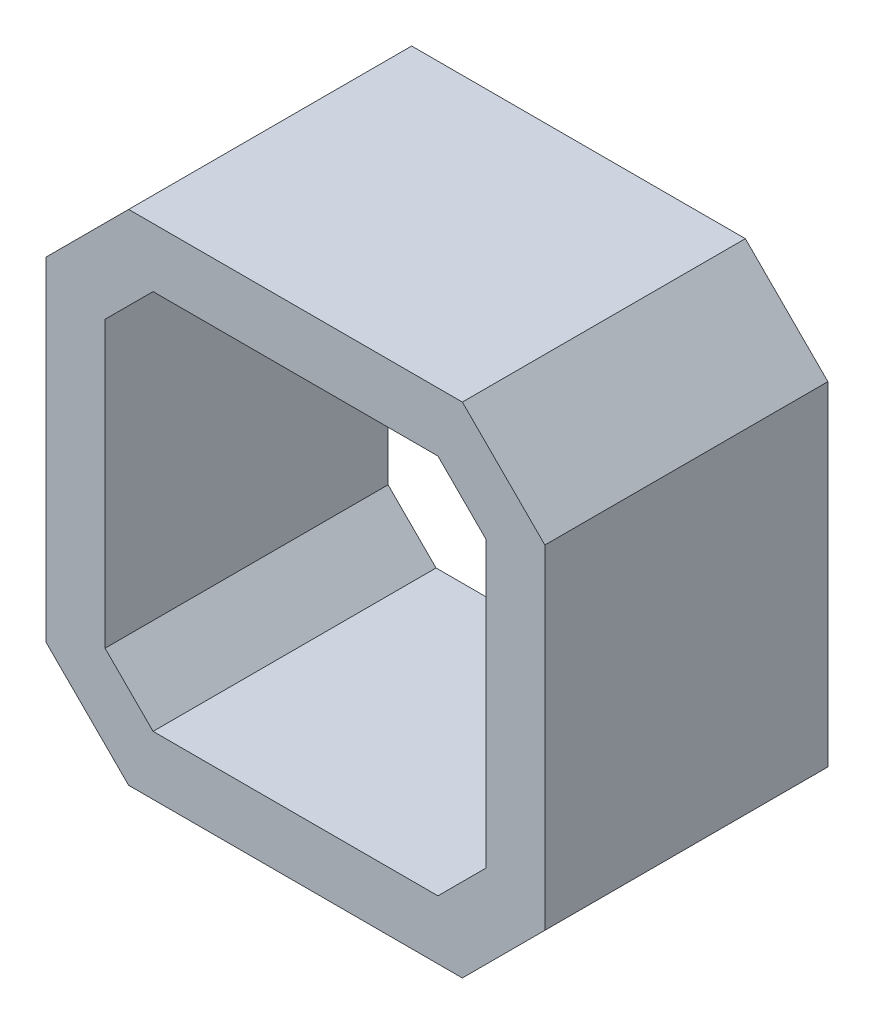
ISO-10303-21;
HEADER;
FILE_DESCRIPTION(('STEP AP214'),'2;1');
FILE_NAME('part.step','',(''),(''),'','','');
FILE_SCHEMA(('AUTOMOTIVE_DESIGN { 1 0 10303 214 1 1 1 1 }'));
ENDSEC;
DATA;
#1=APPLICATION_CONTEXT('core data for automotive mechanical design processes');
#2=APPLICATION_PROTOCOL_DEFINITION('international standard','automotive_design',2000,#1);
#3=PRODUCT_CONTEXT('',#1,'mechanical');
#4=PRODUCT('Part','Part','',(#3));
#5=PRODUCT_RELATED_PRODUCT_CATEGORY('part','',(#4));
#6=PRODUCT_DEFINITION_FORMATION('','',#4);
#7=PRODUCT_DEFINITION_CONTEXT('part definition',#1,'design');
#8=PRODUCT_DEFINITION('design','',#6,#7);
#9=PRODUCT_DEFINITION_SHAPE('','',#8);
#10=(LENGTH_UNIT() NAMED_UNIT(*) SI_UNIT(.MILLI.,.METRE.));
#11=(NAMED_UNIT(*) PLANE_ANGLE_UNIT() SI_UNIT($,.RADIAN.));
#12=(NAMED_UNIT(*) SI_UNIT($,.STERADIAN.) SOLID_ANGLE_UNIT());
#13=UNCERTAINTY_MEASURE_WITH_UNIT(LENGTH_MEASURE(1.E-05),#10,'distance_accuracy_value','');
#14=(GEOMETRIC_REPRESENTATION_CONTEXT(3) GLOBAL_UNCERTAINTY_ASSIGNED_CONTEXT((#13)) GLOBAL_UNIT_ASSIGNED_CONTEXT((#10,
#11,#12)) REPRESENTATION_CONTEXT('',''));
#15=CARTESIAN_POINT('',(0.,0.,0.));
#16=DIRECTION('',(0.,0.,1.));
#17=DIRECTION('',(1.,0.,0.));
#18=AXIS2_PLACEMENT_3D('',#15,#16,#17);
#19=CARTESIAN_POINT('',(0.,0.,-24.));
#20=DIRECTION('',(0.,0.,1.));
#21=DIRECTION('',(-1.,0.,0.));
#22=AXIS2_PLACEMENT_3D('',#19,#20,#21);
#23=PLANE('',#22);
#24=DIRECTION('',(0.,-1.,0.));
#25=VECTOR('',#24,1.);
#26=CARTESIAN_POINT('',(-21.15,-14.15,-24.));
#27=LINE('',#26,#25);
#28=CARTESIAN_POINT('',(-21.15,14.15,-24.));
#29=VERTEX_POINT('',#28);
#30=CARTESIAN_POINT('',(-21.15,-14.15,-24.));
#31=VERTEX_POINT('',#30);
#32=EDGE_CURVE('E215',#29,#31,#27,.T.);
#33=ORIENTED_EDGE('',*,*,#32,.F.);
#34=DIRECTION('',(-0.707106781186547,-0.707106781186547,0.));
#35=VECTOR('',#34,1.);
#36=CARTESIAN_POINT('',(-21.15,14.15,-24.));
#37=LINE('',#36,#35);
#38=CARTESIAN_POINT('',(-14.15,21.15,-24.));
#39=VERTEX_POINT('',#38);
#40=EDGE_CURVE('E237',#39,#29,#37,.T.);
#41=ORIENTED_EDGE('',*,*,#40,.F.);
#42=DIRECTION('',(-1.,0.,0.));
#43=VECTOR('',#42,1.);
#44=CARTESIAN_POINT('',(-14.15,21.15,-24.));
#45=LINE('',#44,#43);
#46=CARTESIAN_POINT('',(14.15,21.15,-24.));
#47=VERTEX_POINT('',#46);
#48=EDGE_CURVE('E234',#47,#39,#45,.T.);
#49=ORIENTED_EDGE('',*,*,#48,.F.);
#50=DIRECTION('',(-0.707106781186547,0.707106781186547,0.));
#51=VECTOR('',#50,1.);
#52=CARTESIAN_POINT('',(14.15,21.15,-24.));
#53=LINE('',#52,#51);
#54=CARTESIAN_POINT('',(21.15,14.15,-24.));
#55=VERTEX_POINT('',#54);
#56=EDGE_CURVE('E231',#55,#47,#53,.T.);
#57=ORIENTED_EDGE('',*,*,#56,.F.);
#58=DIRECTION('',(0.,1.,0.));
#59=VECTOR('',#58,1.);
#60=CARTESIAN_POINT('',(21.15,-14.15,-24.));
#61=LINE('',#60,#59);
#62=CARTESIAN_POINT('',(21.15,-14.15,-24.));
#63=VERTEX_POINT('',#62);
#64=EDGE_CURVE('E228',#63,#55,#61,.T.);
#65=ORIENTED_EDGE('',*,*,#64,.F.);
#66=DIRECTION('',(0.707106781186547,0.707106781186547,0.));
#67=VECTOR('',#66,1.);
#68=CARTESIAN_POINT('',(14.15,-21.15,-24.));
#69=LINE('',#68,#67);
#70=CARTESIAN_POINT('',(14.15,-21.15,-24.));
#71=VERTEX_POINT('',#70);
#72=EDGE_CURVE('E225',#71,#63,#69,.T.);
#73=ORIENTED_EDGE('',*,*,#72,.F.);
#74=DIRECTION('',(1.,0.,0.));
#75=VECTOR('',#74,1.);
#76=CARTESIAN_POINT('',(-14.15,-21.15,-24.));
#77=LINE('',#76,#75);
#78=CARTESIAN_POINT('',(-14.15,-21.15,-24.));
#79=VERTEX_POINT('',#78);
#80=EDGE_CURVE('E222',#79,#71,#77,.T.);
#81=ORIENTED_EDGE('',*,*,#80,.F.);
#82=DIRECTION('',(0.707106781186547,-0.707106781186547,0.));
#83=VECTOR('',#82,1.);
#84=CARTESIAN_POINT('',(-21.15,-14.15,-24.));
#85=LINE('',#84,#83);
#86=EDGE_CURVE('E218',#31,#79,#85,.T.);
#87=ORIENTED_EDGE('',*,*,#86,.F.);
#88=EDGE_LOOP('',(#33,#41,#49,#57,#65,#73,#81,#87));
#89=FACE_BOUND('',#88,.T.);
#90=DIRECTION('',(-0.707106781186547,-0.707106781186547,0.));
#91=VECTOR('',#90,1.);
#92=CARTESIAN_POINT('',(-16.15,12.0789321881345,-24.));
#93=LINE('',#92,#91);
#94=CARTESIAN_POINT('',(-12.0789321881345,16.15,-24.));
#95=VERTEX_POINT('',#94);
#96=CARTESIAN_POINT('',(-16.15,12.0789321881345,-24.));
#97=VERTEX_POINT('',#96);
#98=EDGE_CURVE('E150',#95,#97,#93,.T.);
#99=ORIENTED_EDGE('',*,*,#98,.T.);
#100=DIRECTION('',(0.,-1.,0.));
#101=VECTOR('',#100,1.);
#102=CARTESIAN_POINT('',(-16.15,-12.0789321881345,-24.));
#103=LINE('',#102,#101);
#104=CARTESIAN_POINT('',(-16.15,-12.0789321881345,-24.));
#105=VERTEX_POINT('',#104);
#106=EDGE_CURVE('E159',#97,#105,#103,.T.);
#107=ORIENTED_EDGE('',*,*,#106,.T.);
#108=DIRECTION('',(0.707106781186547,-0.707106781186547,0.));
#109=VECTOR('',#108,1.);
#110=CARTESIAN_POINT('',(-16.15,-12.0789321881345,-24.));
#111=LINE('',#110,#109);
#112=CARTESIAN_POINT('',(-12.0789321881345,-16.15,-24.));
#113=VERTEX_POINT('',#112);
#114=EDGE_CURVE('E164',#105,#113,#111,.T.);
#115=ORIENTED_EDGE('',*,*,#114,.T.);
#116=DIRECTION('',(1.,0.,0.));
#117=VECTOR('',#116,1.);
#118=CARTESIAN_POINT('',(-12.0789321881345,-16.15,-24.));
#119=LINE('',#118,#117);
#120=CARTESIAN_POINT('',(12.0789321881345,-16.15,-24.));
#121=VERTEX_POINT('',#120);
#122=EDGE_CURVE('E176',#113,#121,#119,.T.);
#123=ORIENTED_EDGE('',*,*,#122,.T.);
#124=DIRECTION('',(0.707106781186547,0.707106781186547,0.));
#125=VECTOR('',#124,1.);
#126=CARTESIAN_POINT('',(12.0789321881345,-16.15,-24.));
#127=LINE('',#126,#125);
#128=CARTESIAN_POINT('',(16.15,-12.0789321881345,-24.));
#129=VERTEX_POINT('',#128);
#130=EDGE_CURVE('E179',#121,#129,#127,.T.);
#131=ORIENTED_EDGE('',*,*,#130,.T.);
#132=DIRECTION('',(0.,1.,0.));
#133=VECTOR('',#132,1.);
#134=CARTESIAN_POINT('',(16.15,-12.0789321881345,-24.));
#135=LINE('',#134,#133);
#136=CARTESIAN_POINT('',(16.15,12.0789321881345,-24.));
#137=VERTEX_POINT('',#136);
#138=EDGE_CURVE('E182',#129,#137,#135,.T.);
#139=ORIENTED_EDGE('',*,*,#138,.T.);
#140=DIRECTION('',(-0.707106781186547,0.707106781186547,0.));
#141=VECTOR('',#140,1.);
#142=CARTESIAN_POINT('',(12.0789321881345,16.15,-24.));
#143=LINE('',#142,#141);
#144=CARTESIAN_POINT('',(12.0789321881345,16.15,-24.));
#145=VERTEX_POINT('',#144);
#146=EDGE_CURVE('E185',#137,#145,#143,.T.);
#147=ORIENTED_EDGE('',*,*,#146,.T.);
#148=DIRECTION('',(-1.,0.,0.));
#149=VECTOR('',#148,1.);
#150=CARTESIAN_POINT('',(-12.0789321881345,16.15,-24.));
#151=LINE('',#150,#149);
#152=EDGE_CURVE('E168',#145,#95,#151,.T.);
#153=ORIENTED_EDGE('',*,*,#152,.T.);
#154=EDGE_LOOP('',(#99,#107,#115,#123,#131,#139,#147,#153));
#155=FACE_BOUND('',#154,.T.);
#156=ADVANCED_FACE('F35',(#89,#155),#23,.F.);
#157=CARTESIAN_POINT('',(0.,0.,0.));
#158=DIRECTION('',(0.,0.,1.));
#159=DIRECTION('',(-1.,0.,0.));
#160=AXIS2_PLACEMENT_3D('',#157,#158,#159);
#161=PLANE('',#160);
#162=DIRECTION('',(0.,-1.,0.));
#163=VECTOR('',#162,1.);
#164=CARTESIAN_POINT('',(-21.15,-14.15,0.));
#165=LINE('',#164,#163);
#166=CARTESIAN_POINT('',(-21.15,14.15,0.));
#167=VERTEX_POINT('',#166);
#168=CARTESIAN_POINT('',(-21.15,-14.15,0.));
#169=VERTEX_POINT('',#168);
#170=EDGE_CURVE('E155',#167,#169,#165,.T.);
#171=ORIENTED_EDGE('',*,*,#170,.T.);
#172=DIRECTION('',(0.707106781186547,-0.707106781186547,0.));
#173=VECTOR('',#172,1.);
#174=CARTESIAN_POINT('',(-21.15,-14.15,0.));
#175=LINE('',#174,#173);
#176=CARTESIAN_POINT('',(-14.15,-21.15,0.));
#177=VERTEX_POINT('',#176);
#178=EDGE_CURVE('E243',#169,#177,#175,.T.);
#179=ORIENTED_EDGE('',*,*,#178,.T.);
#180=DIRECTION('',(1.,0.,0.));
#181=VECTOR('',#180,1.);
#182=CARTESIAN_POINT('',(-14.15,-21.15,0.));
#183=LINE('',#182,#181);
#184=CARTESIAN_POINT('',(14.15,-21.15,0.));
#185=VERTEX_POINT('',#184);
#186=EDGE_CURVE('E246',#177,#185,#183,.T.);
#187=ORIENTED_EDGE('',*,*,#186,.T.);
#188=DIRECTION('',(0.707106781186547,0.707106781186547,0.));
#189=VECTOR('',#188,1.);
#190=CARTESIAN_POINT('',(14.15,-21.15,0.));
#191=LINE('',#190,#189);
#192=CARTESIAN_POINT('',(21.15,-14.15,0.));
#193=VERTEX_POINT('',#192);
#194=EDGE_CURVE('E249',#185,#193,#191,.T.);
#195=ORIENTED_EDGE('',*,*,#194,.T.);
#196=DIRECTION('',(0.,1.,0.));
#197=VECTOR('',#196,1.);
#198=CARTESIAN_POINT('',(21.15,-14.15,0.));
#199=LINE('',#198,#197);
#200=CARTESIAN_POINT('',(21.15,14.15,0.));
#201=VERTEX_POINT('',#200);
#202=EDGE_CURVE('E252',#193,#201,#199,.T.);
#203=ORIENTED_EDGE('',*,*,#202,.T.);
#204=DIRECTION('',(-0.707106781186547,0.707106781186547,0.));
#205=VECTOR('',#204,1.);
#206=CARTESIAN_POINT('',(14.15,21.15,0.));
#207=LINE('',#206,#205);
#208=CARTESIAN_POINT('',(14.15,21.15,0.));
#209=VERTEX_POINT('',#208);
#210=EDGE_CURVE('E255',#201,#209,#207,.T.);
#211=ORIENTED_EDGE('',*,*,#210,.T.);
#212=DIRECTION('',(-1.,0.,0.));
#213=VECTOR('',#212,1.);
#214=CARTESIAN_POINT('',(-14.15,21.15,0.));
#215=LINE('',#214,#213);
#216=CARTESIAN_POINT('',(-14.15,21.15,0.));
#217=VERTEX_POINT('',#216);
#218=EDGE_CURVE('E258',#209,#217,#215,.T.);
#219=ORIENTED_EDGE('',*,*,#218,.T.);
#220=DIRECTION('',(-0.707106781186547,-0.707106781186547,0.));
#221=VECTOR('',#220,1.);
#222=CARTESIAN_POINT('',(-21.15,14.15,0.));
#223=LINE('',#222,#221);
#224=EDGE_CURVE('E219',#217,#167,#223,.T.);
#225=ORIENTED_EDGE('',*,*,#224,.T.);
#226=EDGE_LOOP('',(#171,#179,#187,#195,#203,#211,#219,#225));
#227=FACE_BOUND('',#226,.T.);
#228=DIRECTION('',(-1.,0.,0.));
#229=VECTOR('',#228,1.);
#230=CARTESIAN_POINT('',(-12.0789321881345,16.15,0.));
#231=LINE('',#230,#229);
#232=CARTESIAN_POINT('',(12.0789321881345,16.15,0.));
#233=VERTEX_POINT('',#232);
#234=CARTESIAN_POINT('',(-12.0789321881345,16.15,0.));
#235=VERTEX_POINT('',#234);
#236=EDGE_CURVE('E169',#233,#235,#231,.T.);
#237=ORIENTED_EDGE('',*,*,#236,.F.);
#238=DIRECTION('',(-0.707106781186547,0.707106781186547,0.));
#239=VECTOR('',#238,1.);
#240=CARTESIAN_POINT('',(12.0789321881345,16.15,0.));
#241=LINE('',#240,#239);
#242=CARTESIAN_POINT('',(16.15,12.0789321881345,0.));
#243=VERTEX_POINT('',#242);
#244=EDGE_CURVE('E172',#243,#233,#241,.T.);
#245=ORIENTED_EDGE('',*,*,#244,.F.);
#246=DIRECTION('',(0.,1.,0.));
#247=VECTOR('',#246,1.);
#248=CARTESIAN_POINT('',(16.15,-12.0789321881345,0.));
#249=LINE('',#248,#247);
#250=CARTESIAN_POINT('',(16.15,-12.0789321881345,0.));
#251=VERTEX_POINT('',#250);
#252=EDGE_CURVE('E200',#251,#243,#249,.T.);
#253=ORIENTED_EDGE('',*,*,#252,.F.);
#254=DIRECTION('',(0.707106781186547,0.707106781186547,0.));
#255=VECTOR('',#254,1.);
#256=CARTESIAN_POINT('',(12.0789321881345,-16.15,0.));
#257=LINE('',#256,#255);
#258=CARTESIAN_POINT('',(12.0789321881345,-16.15,0.));
#259=VERTEX_POINT('',#258);
#260=EDGE_CURVE('E197',#259,#251,#257,.T.);
#261=ORIENTED_EDGE('',*,*,#260,.F.);
#262=DIRECTION('',(1.,0.,0.));
#263=VECTOR('',#262,1.);
#264=CARTESIAN_POINT('',(-12.0789321881345,-16.15,0.));
#265=LINE('',#264,#263);
#266=CARTESIAN_POINT('',(-12.0789321881345,-16.15,0.));
#267=VERTEX_POINT('',#266);
#268=EDGE_CURVE('E194',#267,#259,#265,.T.);
#269=ORIENTED_EDGE('',*,*,#268,.F.);
#270=DIRECTION('',(0.707106781186547,-0.707106781186547,0.));
#271=VECTOR('',#270,1.);
#272=CARTESIAN_POINT('',(-16.15,-12.0789321881345,0.));
#273=LINE('',#272,#271);
#274=CARTESIAN_POINT('',(-16.15,-12.0789321881345,0.));
#275=VERTEX_POINT('',#274);
#276=EDGE_CURVE('E191',#275,#267,#273,.T.);
#277=ORIENTED_EDGE('',*,*,#276,.F.);
#278=DIRECTION('',(0.,-1.,0.));
#279=VECTOR('',#278,1.);
#280=CARTESIAN_POINT('',(-16.15,-12.0789321881345,0.));
#281=LINE('',#280,#279);
#282=CARTESIAN_POINT('',(-16.15,12.0789321881345,0.));
#283=VERTEX_POINT('',#282);
#284=EDGE_CURVE('E189',#283,#275,#281,.T.);
#285=ORIENTED_EDGE('',*,*,#284,.F.);
#286=DIRECTION('',(-0.707106781186547,-0.707106781186547,0.));
#287=VECTOR('',#286,1.);
#288=CARTESIAN_POINT('',(-16.15,12.0789321881345,0.));
#289=LINE('',#288,#287);
#290=EDGE_CURVE('E151',#235,#283,#289,.T.);
#291=ORIENTED_EDGE('',*,*,#290,.F.);
#292=EDGE_LOOP('',(#237,#245,#253,#261,#269,#277,#285,#291));
#293=FACE_BOUND('',#292,.T.);
#294=ADVANCED_FACE('F283',(#227,#293),#161,.T.);
#295=CARTESIAN_POINT('',(-21.15,-14.15,-24.));
#296=DIRECTION('',(1.,0.,0.));
#297=DIRECTION('',(0.,0.,1.));
#298=AXIS2_PLACEMENT_3D('',#295,#296,#297);
#299=PLANE('',#298);
#300=ORIENTED_EDGE('',*,*,#170,.F.);
#301=DIRECTION('',(0.,0.,1.));
#302=VECTOR('',#301,1.);
#303=CARTESIAN_POINT('',(-21.15,14.15,-24.));
#304=LINE('',#303,#302);
#305=EDGE_CURVE('E240',#29,#167,#304,.T.);
#306=ORIENTED_EDGE('',*,*,#305,.F.);
#307=ORIENTED_EDGE('',*,*,#32,.T.);
#308=DIRECTION('',(0.,0.,1.));
#309=VECTOR('',#308,1.);
#310=CARTESIAN_POINT('',(-21.15,-14.15,-24.));
#311=LINE('',#310,#309);
#312=EDGE_CURVE('E11',#31,#169,#311,.T.);
#313=ORIENTED_EDGE('',*,*,#312,.T.);
#314=EDGE_LOOP('',(#300,#306,#307,#313));
#315=FACE_BOUND('',#314,.T.);
#316=ADVANCED_FACE('F37',(#315),#299,.F.);
#317=CARTESIAN_POINT('',(-21.15,-14.15,-24.));
#318=DIRECTION('',(0.707106781186548,0.707106781186548,0.));
#319=DIRECTION('',(-0.707106781186548,0.707106781186548,0.));
#320=AXIS2_PLACEMENT_3D('',#317,#318,#319);
#321=PLANE('',#320);
#322=ORIENTED_EDGE('',*,*,#178,.F.);
#323=ORIENTED_EDGE('',*,*,#312,.F.);
#324=ORIENTED_EDGE('',*,*,#86,.T.);
#325=DIRECTION('',(0.,0.,1.));
#326=VECTOR('',#325,1.);
#327=CARTESIAN_POINT('',(-14.15,-21.15,-24.));
#328=LINE('',#327,#326);
#329=EDGE_CURVE('E43',#79,#177,#328,.T.);
#330=ORIENTED_EDGE('',*,*,#329,.T.);
#331=EDGE_LOOP('',(#322,#323,#324,#330));
#332=FACE_BOUND('',#331,.T.);
#333=ADVANCED_FACE('F276',(#332),#321,.F.);
#334=CARTESIAN_POINT('',(-14.15,-21.15,-24.));
#335=DIRECTION('',(0.,1.,0.));
#336=DIRECTION('',(0.,0.,-1.));
#337=AXIS2_PLACEMENT_3D('',#334,#335,#336);
#338=PLANE('',#337);
#339=ORIENTED_EDGE('',*,*,#186,.F.);
#340=ORIENTED_EDGE('',*,*,#329,.F.);
#341=ORIENTED_EDGE('',*,*,#80,.T.);
#342=DIRECTION('',(0.,0.,1.));
#343=VECTOR('',#342,1.);
#344=CARTESIAN_POINT('',(14.15,-21.15,-24.));
#345=LINE('',#344,#343);
#346=EDGE_CURVE('E272',#71,#185,#345,.T.);
#347=ORIENTED_EDGE('',*,*,#346,.T.);
#348=EDGE_LOOP('',(#339,#340,#341,#347));
#349=FACE_BOUND('',#348,.T.);
#350=ADVANCED_FACE('F280',(#349),#338,.F.);
#351=CARTESIAN_POINT('',(14.15,-21.15,-24.));
#352=DIRECTION('',(-0.707106781186548,0.707106781186548,0.));
#353=DIRECTION('',(-0.707106781186548,-0.707106781186548,0.));
#354=AXIS2_PLACEMENT_3D('',#351,#352,#353);
#355=PLANE('',#354);
#356=ORIENTED_EDGE('',*,*,#194,.F.);
#357=ORIENTED_EDGE('',*,*,#346,.F.);
#358=ORIENTED_EDGE('',*,*,#72,.T.);
#359=DIRECTION('',(0.,0.,1.));
#360=VECTOR('',#359,1.);
#361=CARTESIAN_POINT('',(21.15,-14.15,-24.));
#362=LINE('',#361,#360);
#363=EDGE_CURVE('E270',#63,#193,#362,.T.);
#364=ORIENTED_EDGE('',*,*,#363,.T.);
#365=EDGE_LOOP('',(#356,#357,#358,#364));
#366=FACE_BOUND('',#365,.T.);
#367=ADVANCED_FACE('F295',(#366),#355,.F.);
#368=CARTESIAN_POINT('',(21.15,-14.15,-24.));
#369=DIRECTION('',(-1.,0.,0.));
#370=DIRECTION('',(0.,0.,-1.));
#371=AXIS2_PLACEMENT_3D('',#368,#369,#370);
#372=PLANE('',#371);
#373=ORIENTED_EDGE('',*,*,#202,.F.);
#374=ORIENTED_EDGE('',*,*,#363,.F.);
#375=ORIENTED_EDGE('',*,*,#64,.T.);
#376=DIRECTION('',(0.,0.,1.));
#377=VECTOR('',#376,1.);
#378=CARTESIAN_POINT('',(21.15,14.15,-24.));
#379=LINE('',#378,#377);
#380=EDGE_CURVE('E268',#55,#201,#379,.T.);
#381=ORIENTED_EDGE('',*,*,#380,.T.);
#382=EDGE_LOOP('',(#373,#374,#375,#381));
#383=FACE_BOUND('',#382,.T.);
#384=ADVANCED_FACE('F299',(#383),#372,.F.);
#385=CARTESIAN_POINT('',(14.15,21.15,-24.));
#386=DIRECTION('',(-0.707106781186548,-0.707106781186548,0.));
#387=DIRECTION('',(0.707106781186548,-0.707106781186548,0.));
#388=AXIS2_PLACEMENT_3D('',#385,#386,#387);
#389=PLANE('',#388);
#390=ORIENTED_EDGE('',*,*,#210,.F.);
#391=ORIENTED_EDGE('',*,*,#380,.F.);
#392=ORIENTED_EDGE('',*,*,#56,.T.);
#393=DIRECTION('',(0.,0.,1.));
#394=VECTOR('',#393,1.);
#395=CARTESIAN_POINT('',(14.15,21.15,-24.));
#396=LINE('',#395,#394);
#397=EDGE_CURVE('E266',#47,#209,#396,.T.);
#398=ORIENTED_EDGE('',*,*,#397,.T.);
#399=EDGE_LOOP('',(#390,#391,#392,#398));
#400=FACE_BOUND('',#399,.T.);
#401=ADVANCED_FACE('F301',(#400),#389,.F.);
#402=CARTESIAN_POINT('',(-14.15,21.15,-24.));
#403=DIRECTION('',(0.,-1.,0.));
#404=DIRECTION('',(0.,0.,1.));
#405=AXIS2_PLACEMENT_3D('',#402,#403,#404);
#406=PLANE('',#405);
#407=ORIENTED_EDGE('',*,*,#218,.F.);
#408=ORIENTED_EDGE('',*,*,#397,.F.);
#409=ORIENTED_EDGE('',*,*,#48,.T.);
#410=DIRECTION('',(0.,0.,1.));
#411=VECTOR('',#410,1.);
#412=CARTESIAN_POINT('',(-14.15,21.15,-24.));
#413=LINE('',#412,#411);
#414=EDGE_CURVE('E264',#39,#217,#413,.T.);
#415=ORIENTED_EDGE('',*,*,#414,.T.);
#416=EDGE_LOOP('',(#407,#408,#409,#415));
#417=FACE_BOUND('',#416,.T.);
#418=ADVANCED_FACE('F305',(#417),#406,.F.);
#419=CARTESIAN_POINT('',(-21.15,14.15,-24.));
#420=DIRECTION('',(0.707106781186548,-0.707106781186548,0.));
#421=DIRECTION('',(0.707106781186548,0.707106781186548,0.));
#422=AXIS2_PLACEMENT_3D('',#419,#420,#421);
#423=PLANE('',#422);
#424=ORIENTED_EDGE('',*,*,#224,.F.);
#425=ORIENTED_EDGE('',*,*,#414,.F.);
#426=ORIENTED_EDGE('',*,*,#40,.T.);
#427=ORIENTED_EDGE('',*,*,#305,.T.);
#428=EDGE_LOOP('',(#424,#425,#426,#427));
#429=FACE_BOUND('',#428,.T.);
#430=ADVANCED_FACE('F307',(#429),#423,.F.);
#431=CARTESIAN_POINT('',(-16.15,12.0789321881345,-24.));
#432=DIRECTION('',(0.707106781186548,-0.707106781186548,0.));
#433=DIRECTION('',(0.707106781186548,0.707106781186548,0.));
#434=AXIS2_PLACEMENT_3D('',#431,#432,#433);
#435=PLANE('',#434);
#436=ORIENTED_EDGE('',*,*,#290,.T.);
#437=DIRECTION('',(0.,0.,1.));
#438=VECTOR('',#437,1.);
#439=CARTESIAN_POINT('',(-16.15,12.0789321881345,-24.));
#440=LINE('',#439,#438);
#441=EDGE_CURVE('E146',#97,#283,#440,.T.);
#442=ORIENTED_EDGE('',*,*,#441,.F.);
#443=ORIENTED_EDGE('',*,*,#98,.F.);
#444=DIRECTION('',(0.,0.,1.));
#445=VECTOR('',#444,1.);
#446=CARTESIAN_POINT('',(-12.0789321881345,16.15,-24.));
#447=LINE('',#446,#445);
#448=EDGE_CURVE('E58',#95,#235,#447,.T.);
#449=ORIENTED_EDGE('',*,*,#448,.T.);
#450=EDGE_LOOP('',(#436,#442,#443,#449));
#451=FACE_BOUND('',#450,.T.);
#452=ADVANCED_FACE('F148',(#451),#435,.T.);
#453=CARTESIAN_POINT('',(-16.15,-12.0789321881345,-24.));
#454=DIRECTION('',(1.,0.,0.));
#455=DIRECTION('',(0.,0.,1.));
#456=AXIS2_PLACEMENT_3D('',#453,#454,#455);
#457=PLANE('',#456);
#458=ORIENTED_EDGE('',*,*,#284,.T.);
#459=DIRECTION('',(0.,0.,1.));
#460=VECTOR('',#459,1.);
#461=CARTESIAN_POINT('',(-16.15,-12.0789321881345,-24.));
#462=LINE('',#461,#460);
#463=EDGE_CURVE('E156',#105,#275,#462,.T.);
#464=ORIENTED_EDGE('',*,*,#463,.F.);
#465=ORIENTED_EDGE('',*,*,#106,.F.);
#466=ORIENTED_EDGE('',*,*,#441,.T.);
#467=EDGE_LOOP('',(#458,#464,#465,#466));
#468=FACE_BOUND('',#467,.T.);
#469=ADVANCED_FACE('F160',(#468),#457,.T.);
#470=CARTESIAN_POINT('',(-16.15,-12.0789321881345,-24.));
#471=DIRECTION('',(0.707106781186548,0.707106781186548,0.));
#472=DIRECTION('',(-0.707106781186548,0.707106781186548,0.));
#473=AXIS2_PLACEMENT_3D('',#470,#471,#472);
#474=PLANE('',#473);
#475=ORIENTED_EDGE('',*,*,#276,.T.);
#476=DIRECTION('',(0.,0.,1.));
#477=VECTOR('',#476,1.);
#478=CARTESIAN_POINT('',(-12.0789321881345,-16.15,-24.));
#479=LINE('',#478,#477);
#480=EDGE_CURVE('E212',#113,#267,#479,.T.);
#481=ORIENTED_EDGE('',*,*,#480,.F.);
#482=ORIENTED_EDGE('',*,*,#114,.F.);
#483=ORIENTED_EDGE('',*,*,#463,.T.);
#484=EDGE_LOOP('',(#475,#481,#482,#483));
#485=FACE_BOUND('',#484,.T.);
#486=ADVANCED_FACE('F325',(#485),#474,.T.);
#487=CARTESIAN_POINT('',(-12.0789321881345,-16.15,-24.));
#488=DIRECTION('',(0.,1.,0.));
#489=DIRECTION('',(0.,0.,-1.));
#490=AXIS2_PLACEMENT_3D('',#487,#488,#489);
#491=PLANE('',#490);
#492=ORIENTED_EDGE('',*,*,#268,.T.);
#493=DIRECTION('',(0.,0.,1.));
#494=VECTOR('',#493,1.);
#495=CARTESIAN_POINT('',(12.0789321881345,-16.15,-24.));
#496=LINE('',#495,#494);
#497=EDGE_CURVE('E210',#121,#259,#496,.T.);
#498=ORIENTED_EDGE('',*,*,#497,.F.);
#499=ORIENTED_EDGE('',*,*,#122,.F.);
#500=ORIENTED_EDGE('',*,*,#480,.T.);
#501=EDGE_LOOP('',(#492,#498,#499,#500));
#502=FACE_BOUND('',#501,.T.);
#503=ADVANCED_FACE('F328',(#502),#491,.T.);
#504=CARTESIAN_POINT('',(12.0789321881345,-16.15,-24.));
#505=DIRECTION('',(-0.707106781186548,0.707106781186548,0.));
#506=DIRECTION('',(-0.707106781186548,-0.707106781186548,0.));
#507=AXIS2_PLACEMENT_3D('',#504,#505,#506);
#508=PLANE('',#507);
#509=ORIENTED_EDGE('',*,*,#260,.T.);
#510=DIRECTION('',(0.,0.,1.));
#511=VECTOR('',#510,1.);
#512=CARTESIAN_POINT('',(16.15,-12.0789321881345,-24.));
#513=LINE('',#512,#511);
#514=EDGE_CURVE('E208',#129,#251,#513,.T.);
#515=ORIENTED_EDGE('',*,*,#514,.F.);
#516=ORIENTED_EDGE('',*,*,#130,.F.);
#517=ORIENTED_EDGE('',*,*,#497,.T.);
#518=EDGE_LOOP('',(#509,#515,#516,#517));
#519=FACE_BOUND('',#518,.T.);
#520=ADVANCED_FACE('F332',(#519),#508,.T.);
#521=CARTESIAN_POINT('',(16.15,-12.0789321881345,-24.));
#522=DIRECTION('',(-1.,0.,0.));
#523=DIRECTION('',(0.,0.,-1.));
#524=AXIS2_PLACEMENT_3D('',#521,#522,#523);
#525=PLANE('',#524);
#526=ORIENTED_EDGE('',*,*,#252,.T.);
#527=DIRECTION('',(0.,0.,1.));
#528=VECTOR('',#527,1.);
#529=CARTESIAN_POINT('',(16.15,12.0789321881345,-24.));
#530=LINE('',#529,#528);
#531=EDGE_CURVE('E206',#137,#243,#530,.T.);
#532=ORIENTED_EDGE('',*,*,#531,.F.);
#533=ORIENTED_EDGE('',*,*,#138,.F.);
#534=ORIENTED_EDGE('',*,*,#514,.T.);
#535=EDGE_LOOP('',(#526,#532,#533,#534));
#536=FACE_BOUND('',#535,.T.);
#537=ADVANCED_FACE('F336',(#536),#525,.T.);
#538=CARTESIAN_POINT('',(12.0789321881345,16.15,-24.));
#539=DIRECTION('',(-0.707106781186548,-0.707106781186548,0.));
#540=DIRECTION('',(0.707106781186548,-0.707106781186548,0.));
#541=AXIS2_PLACEMENT_3D('',#538,#539,#540);
#542=PLANE('',#541);
#543=ORIENTED_EDGE('',*,*,#244,.T.);
#544=DIRECTION('',(0.,0.,1.));
#545=VECTOR('',#544,1.);
#546=CARTESIAN_POINT('',(12.0789321881345,16.15,-24.));
#547=LINE('',#546,#545);
#548=EDGE_CURVE('E50',#145,#233,#547,.T.);
#549=ORIENTED_EDGE('',*,*,#548,.F.);
#550=ORIENTED_EDGE('',*,*,#146,.F.);
#551=ORIENTED_EDGE('',*,*,#531,.T.);
#552=EDGE_LOOP('',(#543,#549,#550,#551));
#553=FACE_BOUND('',#552,.T.);
#554=ADVANCED_FACE('F340',(#553),#542,.T.);
#555=CARTESIAN_POINT('',(-12.0789321881345,16.15,-24.));
#556=DIRECTION('',(0.,-1.,0.));
#557=DIRECTION('',(0.,0.,1.));
#558=AXIS2_PLACEMENT_3D('',#555,#556,#557);
#559=PLANE('',#558);
#560=ORIENTED_EDGE('',*,*,#236,.T.);
#561=ORIENTED_EDGE('',*,*,#448,.F.);
#562=ORIENTED_EDGE('',*,*,#152,.F.);
#563=ORIENTED_EDGE('',*,*,#548,.T.);
#564=EDGE_LOOP('',(#560,#561,#562,#563));
#565=FACE_BOUND('',#564,.T.);
#566=ADVANCED_FACE('F344',(#565),#559,.T.);
#567=CLOSED_SHELL('',(#156,#294,#316,#333,#350,#367,#384,#401,#418,#430,#452,#469,#486,#503,
#520,#537,#554,#566));
#568=MANIFOLD_SOLID_BREP('B2',#567);
#569=ADVANCED_BREP_SHAPE_REPRESENTATION('',(#18,#568),#14);
#570=SHAPE_DEFINITION_REPRESENTATION(#9,#569);
ENDSEC;
END-ISO-10303-21;
